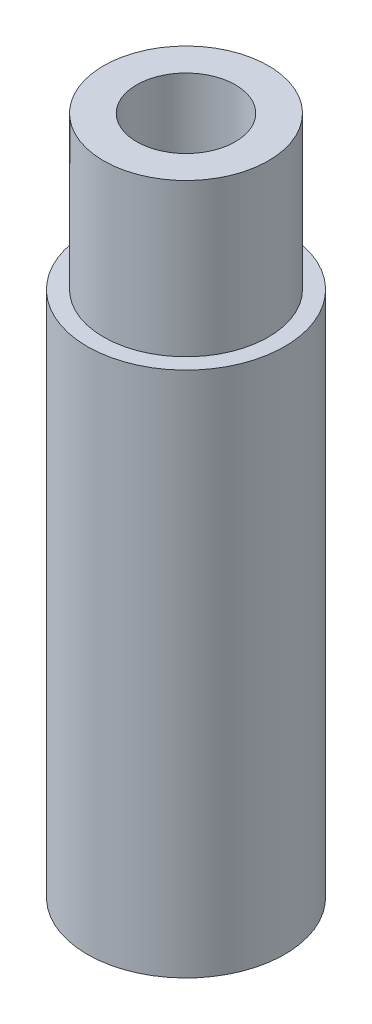
ISO-10303-21;
HEADER;
FILE_DESCRIPTION(('STEP AP214'),'2;1');
FILE_NAME('part.step','',(''),(''),'','','');
FILE_SCHEMA(('AUTOMOTIVE_DESIGN { 1 0 10303 214 1 1 1 1 }'));
ENDSEC;
DATA;
#1=APPLICATION_CONTEXT('core data for automotive mechanical design processes');
#2=APPLICATION_PROTOCOL_DEFINITION('international standard','automotive_design',2000,#1);
#3=PRODUCT_CONTEXT('',#1,'mechanical');
#4=PRODUCT('Part','Part','',(#3));
#5=PRODUCT_RELATED_PRODUCT_CATEGORY('part','',(#4));
#6=PRODUCT_DEFINITION_FORMATION('','',#4);
#7=PRODUCT_DEFINITION_CONTEXT('part definition',#1,'design');
#8=PRODUCT_DEFINITION('design','',#6,#7);
#9=PRODUCT_DEFINITION_SHAPE('','',#8);
#10=(LENGTH_UNIT() NAMED_UNIT(*) SI_UNIT(.MILLI.,.METRE.));
#11=(NAMED_UNIT(*) PLANE_ANGLE_UNIT() SI_UNIT($,.RADIAN.));
#12=(NAMED_UNIT(*) SI_UNIT($,.STERADIAN.) SOLID_ANGLE_UNIT());
#13=UNCERTAINTY_MEASURE_WITH_UNIT(LENGTH_MEASURE(1.E-05),#10,'distance_accuracy_value','');
#14=(GEOMETRIC_REPRESENTATION_CONTEXT(3) GLOBAL_UNCERTAINTY_ASSIGNED_CONTEXT((#13)) GLOBAL_UNIT_ASSIGNED_CONTEXT((#10,
#11,#12)) REPRESENTATION_CONTEXT('',''));
#15=CARTESIAN_POINT('',(0.,0.,0.));
#16=DIRECTION('',(0.,0.,1.));
#17=DIRECTION('',(1.,0.,0.));
#18=AXIS2_PLACEMENT_3D('',#15,#16,#17);
#19=CARTESIAN_POINT('',(0.,32.766,0.));
#20=DIRECTION('',(0.,-1.,0.));
#21=DIRECTION('',(0.,0.,-1.));
#22=AXIS2_PLACEMENT_3D('',#19,#20,#21);
#23=CYLINDRICAL_SURFACE('',#22,2.38125);
#24=CARTESIAN_POINT('',(0.,32.766,0.));
#25=DIRECTION('',(0.,-1.,0.));
#26=DIRECTION('',(0.,0.,-1.));
#27=AXIS2_PLACEMENT_3D('',#24,#25,#26);
#28=CIRCLE('',#27,2.38125);
#29=CARTESIAN_POINT('',(0.,32.766,-2.38125));
#30=VERTEX_POINT('',#29);
#31=EDGE_CURVE('E49',#30,#30,#28,.T.);
#32=ORIENTED_EDGE('',*,*,#31,.F.);
#33=EDGE_LOOP('',(#32));
#34=FACE_BOUND('',#33,.T.);
#35=CARTESIAN_POINT('',(0.,12.7,0.));
#36=DIRECTION('',(0.,-1.,0.));
#37=DIRECTION('',(0.,0.,-1.));
#38=AXIS2_PLACEMENT_3D('',#35,#36,#37);
#39=CIRCLE('',#38,2.38125);
#40=CARTESIAN_POINT('',(0.,12.7,-2.38125));
#41=VERTEX_POINT('',#40);
#42=EDGE_CURVE('E35',#41,#41,#39,.F.);
#43=ORIENTED_EDGE('',*,*,#42,.F.);
#44=EDGE_LOOP('',(#43));
#45=FACE_BOUND('',#44,.T.);
#46=ADVANCED_FACE('F31',(#34,#45),#23,.F.);
#47=CARTESIAN_POINT('',(0.,25.4,0.));
#48=DIRECTION('',(0.,1.,0.));
#49=DIRECTION('',(0.,0.,1.));
#50=AXIS2_PLACEMENT_3D('',#47,#48,#49);
#51=PLANE('',#50);
#52=CARTESIAN_POINT('',(0.,25.4,0.));
#53=DIRECTION('',(0.,1.,0.));
#54=DIRECTION('',(0.,0.,1.));
#55=AXIS2_PLACEMENT_3D('',#52,#53,#54);
#56=CIRCLE('',#55,4.7625);
#57=CARTESIAN_POINT('',(0.,25.4,4.7625));
#58=VERTEX_POINT('',#57);
#59=EDGE_CURVE('E10',#58,#58,#56,.T.);
#60=ORIENTED_EDGE('',*,*,#59,.T.);
#61=EDGE_LOOP('',(#60));
#62=FACE_BOUND('',#61,.T.);
#63=CARTESIAN_POINT('',(0.,25.4,0.));
#64=DIRECTION('',(0.,1.,0.));
#65=DIRECTION('',(0.,0.,1.));
#66=AXIS2_PLACEMENT_3D('',#63,#64,#65);
#67=CIRCLE('',#66,3.9751);
#68=CARTESIAN_POINT('',(0.,25.4,3.9751));
#69=VERTEX_POINT('',#68);
#70=EDGE_CURVE('E46',#69,#69,#67,.T.);
#71=ORIENTED_EDGE('',*,*,#70,.F.);
#72=EDGE_LOOP('',(#71));
#73=FACE_BOUND('',#72,.T.);
#74=ADVANCED_FACE('F67',(#62,#73),#51,.T.);
#75=CARTESIAN_POINT('',(0.,25.4,0.));
#76=DIRECTION('',(0.,-1.,0.));
#77=DIRECTION('',(0.,0.,-1.));
#78=AXIS2_PLACEMENT_3D('',#75,#76,#77);
#79=CYLINDRICAL_SURFACE('',#78,4.7625);
#80=ORIENTED_EDGE('',*,*,#59,.F.);
#81=EDGE_LOOP('',(#80));
#82=FACE_BOUND('',#81,.T.);
#83=CARTESIAN_POINT('',(0.,0.,0.));
#84=DIRECTION('',(0.,1.,0.));
#85=DIRECTION('',(0.,0.,1.));
#86=AXIS2_PLACEMENT_3D('',#83,#84,#85);
#87=CIRCLE('',#86,4.7625);
#88=CARTESIAN_POINT('',(0.,0.,4.7625));
#89=VERTEX_POINT('',#88);
#90=EDGE_CURVE('E39',#89,#89,#87,.T.);
#91=ORIENTED_EDGE('',*,*,#90,.T.);
#92=EDGE_LOOP('',(#91));
#93=FACE_BOUND('',#92,.T.);
#94=ADVANCED_FACE('F33',(#82,#93),#79,.T.);
#95=CARTESIAN_POINT('',(0.,0.,0.));
#96=DIRECTION('',(0.,1.,0.));
#97=DIRECTION('',(0.,0.,1.));
#98=AXIS2_PLACEMENT_3D('',#95,#96,#97);
#99=PLANE('',#98);
#100=CARTESIAN_POINT('',(0.,0.,0.));
#101=DIRECTION('',(0.,-1.,0.));
#102=DIRECTION('',(0.,0.,-1.));
#103=AXIS2_PLACEMENT_3D('',#100,#101,#102);
#104=CIRCLE('',#103,3.4544);
#105=CARTESIAN_POINT('',(0.,0.,-3.4544));
#106=VERTEX_POINT('',#105);
#107=EDGE_CURVE('E54',#106,#106,#104,.T.);
#108=ORIENTED_EDGE('',*,*,#107,.F.);
#109=EDGE_LOOP('',(#108));
#110=FACE_BOUND('',#109,.T.);
#111=ORIENTED_EDGE('',*,*,#90,.F.);
#112=EDGE_LOOP('',(#111));
#113=FACE_BOUND('',#112,.T.);
#114=ADVANCED_FACE('F85',(#110,#113),#99,.F.);
#115=CARTESIAN_POINT('',(0.,32.766,0.));
#116=DIRECTION('',(0.,-1.,0.));
#117=DIRECTION('',(0.,0.,-1.));
#118=AXIS2_PLACEMENT_3D('',#115,#116,#117);
#119=CYLINDRICAL_SURFACE('',#118,3.9751);
#120=CARTESIAN_POINT('',(0.,32.766,0.));
#121=DIRECTION('',(0.,1.,0.));
#122=DIRECTION('',(0.,0.,1.));
#123=AXIS2_PLACEMENT_3D('',#120,#121,#122);
#124=CIRCLE('',#123,3.9751);
#125=CARTESIAN_POINT('',(0.,32.766,3.9751));
#126=VERTEX_POINT('',#125);
#127=EDGE_CURVE('E44',#126,#126,#124,.T.);
#128=ORIENTED_EDGE('',*,*,#127,.F.);
#129=EDGE_LOOP('',(#128));
#130=FACE_BOUND('',#129,.T.);
#131=ORIENTED_EDGE('',*,*,#70,.T.);
#132=EDGE_LOOP('',(#131));
#133=FACE_BOUND('',#132,.T.);
#134=ADVANCED_FACE('F82',(#130,#133),#119,.T.);
#135=CARTESIAN_POINT('',(0.,32.766,0.));
#136=DIRECTION('',(0.,1.,0.));
#137=DIRECTION('',(0.,0.,1.));
#138=AXIS2_PLACEMENT_3D('',#135,#136,#137);
#139=PLANE('',#138);
#140=ORIENTED_EDGE('',*,*,#31,.T.);
#141=EDGE_LOOP('',(#140));
#142=FACE_BOUND('',#141,.T.);
#143=ORIENTED_EDGE('',*,*,#127,.T.);
#144=EDGE_LOOP('',(#143));
#145=FACE_BOUND('',#144,.T.);
#146=ADVANCED_FACE('F79',(#142,#145),#139,.T.);
#147=CARTESIAN_POINT('',(0.,12.7,0.));
#148=DIRECTION('',(0.,-1.,0.));
#149=DIRECTION('',(0.,0.,-1.));
#150=AXIS2_PLACEMENT_3D('',#147,#148,#149);
#151=PLANE('',#150);
#152=CARTESIAN_POINT('',(0.,12.7,0.));
#153=DIRECTION('',(0.,-1.,0.));
#154=DIRECTION('',(0.,0.,-1.));
#155=AXIS2_PLACEMENT_3D('',#152,#153,#154);
#156=CIRCLE('',#155,3.4544);
#157=CARTESIAN_POINT('',(0.,12.7,-3.4544));
#158=VERTEX_POINT('',#157);
#159=EDGE_CURVE('E57',#158,#158,#156,.T.);
#160=ORIENTED_EDGE('',*,*,#159,.T.);
#161=EDGE_LOOP('',(#160));
#162=FACE_BOUND('',#161,.T.);
#163=ORIENTED_EDGE('',*,*,#42,.T.);
#164=EDGE_LOOP('',(#163));
#165=FACE_BOUND('',#164,.T.);
#166=ADVANCED_FACE('F64',(#162,#165),#151,.T.);
#167=CARTESIAN_POINT('',(0.,12.7,0.));
#168=DIRECTION('',(0.,-1.,0.));
#169=DIRECTION('',(0.,0.,-1.));
#170=AXIS2_PLACEMENT_3D('',#167,#168,#169);
#171=CYLINDRICAL_SURFACE('',#170,3.4544);
#172=ORIENTED_EDGE('',*,*,#159,.F.);
#173=EDGE_LOOP('',(#172));
#174=FACE_BOUND('',#173,.T.);
#175=ORIENTED_EDGE('',*,*,#107,.T.);
#176=EDGE_LOOP('',(#175));
#177=FACE_BOUND('',#176,.T.);
#178=ADVANCED_FACE('F77',(#174,#177),#171,.F.);
#179=CLOSED_SHELL('',(#46,#74,#94,#114,#134,#146,#166,#178));
#180=MANIFOLD_SOLID_BREP('B2',#179);
#181=ADVANCED_BREP_SHAPE_REPRESENTATION('',(#18,#180),#14);
#182=SHAPE_DEFINITION_REPRESENTATION(#9,#181);
ENDSEC;
END-ISO-10303-21;
